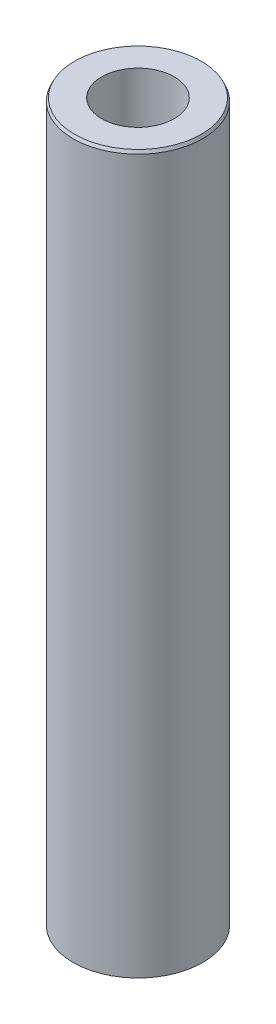
ISO-10303-21;
HEADER;
FILE_DESCRIPTION(('STEP AP214'),'2;1');
FILE_NAME('part.step','',(''),(''),'','','');
FILE_SCHEMA(('AUTOMOTIVE_DESIGN { 1 0 10303 214 1 1 1 1 }'));
ENDSEC;
DATA;
#1=APPLICATION_CONTEXT('core data for automotive mechanical design processes');
#2=APPLICATION_PROTOCOL_DEFINITION('international standard','automotive_design',2000,#1);
#3=PRODUCT_CONTEXT('',#1,'mechanical');
#4=PRODUCT('Part','Part','',(#3));
#5=PRODUCT_RELATED_PRODUCT_CATEGORY('part','',(#4));
#6=PRODUCT_DEFINITION_FORMATION('','',#4);
#7=PRODUCT_DEFINITION_CONTEXT('part definition',#1,'design');
#8=PRODUCT_DEFINITION('design','',#6,#7);
#9=PRODUCT_DEFINITION_SHAPE('','',#8);
#10=(LENGTH_UNIT() NAMED_UNIT(*) SI_UNIT(.MILLI.,.METRE.));
#11=(NAMED_UNIT(*) PLANE_ANGLE_UNIT() SI_UNIT($,.RADIAN.));
#12=(NAMED_UNIT(*) SI_UNIT($,.STERADIAN.) SOLID_ANGLE_UNIT());
#13=UNCERTAINTY_MEASURE_WITH_UNIT(LENGTH_MEASURE(1.E-05),#10,'distance_accuracy_value','');
#14=(GEOMETRIC_REPRESENTATION_CONTEXT(3) GLOBAL_UNCERTAINTY_ASSIGNED_CONTEXT((#13)) GLOBAL_UNIT_ASSIGNED_CONTEXT((#10,
#11,#12)) REPRESENTATION_CONTEXT('',''));
#15=CARTESIAN_POINT('',(0.,0.,0.));
#16=DIRECTION('',(0.,0.,1.));
#17=DIRECTION('',(1.,0.,0.));
#18=AXIS2_PLACEMENT_3D('',#15,#16,#17);
#19=CARTESIAN_POINT('',(0.,415.226512018667,0.));
#20=DIRECTION('',(0.,-1.,0.));
#21=DIRECTION('',(0.,0.,-1.));
#22=AXIS2_PLACEMENT_3D('',#19,#20,#21);
#23=CYLINDRICAL_SURFACE('',#22,37.5);
#24=CARTESIAN_POINT('',(0.,413.442144321352,0.));
#25=DIRECTION('',(0.,1.,0.));
#26=DIRECTION('',(0.,0.,1.));
#27=AXIS2_PLACEMENT_3D('',#24,#25,#26);
#28=CIRCLE('',#27,37.5);
#29=CARTESIAN_POINT('',(0.,413.442144321352,37.5));
#30=VERTEX_POINT('',#29);
#31=EDGE_CURVE('E50',#30,#30,#28,.F.);
#32=ORIENTED_EDGE('',*,*,#31,.T.);
#33=EDGE_LOOP('',(#32));
#34=FACE_BOUND('',#33,.T.);
#35=CARTESIAN_POINT('',(0.,0.858408219421514,0.));
#36=DIRECTION('',(0.,1.,0.));
#37=DIRECTION('',(0.,0.,1.));
#38=AXIS2_PLACEMENT_3D('',#35,#36,#37);
#39=CIRCLE('',#38,37.5);
#40=CARTESIAN_POINT('',(0.,0.858408219421514,37.5));
#41=VERTEX_POINT('',#40);
#42=EDGE_CURVE('E51',#41,#41,#39,.T.);
#43=ORIENTED_EDGE('',*,*,#42,.T.);
#44=EDGE_LOOP('',(#43));
#45=FACE_BOUND('',#44,.T.);
#46=ADVANCED_FACE('F39',(#34,#45),#23,.T.);
#47=CARTESIAN_POINT('',(0.,415.226512018667,0.));
#48=DIRECTION('',(0.,1.,0.));
#49=DIRECTION('',(0.,0.,1.));
#50=AXIS2_PLACEMENT_3D('',#47,#48,#49);
#51=PLANE('',#50);
#52=CARTESIAN_POINT('',(0.,415.226512018667,0.));
#53=DIRECTION('',(0.,1.,0.));
#54=DIRECTION('',(0.,0.,1.));
#55=AXIS2_PLACEMENT_3D('',#52,#53,#54);
#56=CIRCLE('',#55,36.6415917805786);
#57=CARTESIAN_POINT('',(0.,415.226512018667,36.6415917805786));
#58=VERTEX_POINT('',#57);
#59=EDGE_CURVE('E54',#58,#58,#56,.T.);
#60=ORIENTED_EDGE('',*,*,#59,.T.);
#61=EDGE_LOOP('',(#60));
#62=FACE_BOUND('',#61,.T.);
#63=CARTESIAN_POINT('',(0.,415.226512018667,0.));
#64=DIRECTION('',(0.,1.,0.));
#65=DIRECTION('',(0.,0.,1.));
#66=AXIS2_PLACEMENT_3D('',#63,#64,#65);
#67=CIRCLE('',#66,20.9945943141782);
#68=CARTESIAN_POINT('',(0.,415.226512018667,20.9945943141782));
#69=VERTEX_POINT('',#68);
#70=EDGE_CURVE('E58',#69,#69,#67,.T.);
#71=ORIENTED_EDGE('',*,*,#70,.F.);
#72=EDGE_LOOP('',(#71));
#73=FACE_BOUND('',#72,.T.);
#74=ADVANCED_FACE('F69',(#62,#73),#51,.T.);
#75=CARTESIAN_POINT('',(0.,0.,0.));
#76=DIRECTION('',(0.,1.,0.));
#77=DIRECTION('',(0.,0.,1.));
#78=AXIS2_PLACEMENT_3D('',#75,#76,#77);
#79=PLANE('',#78);
#80=CARTESIAN_POINT('',(0.,0.,0.));
#81=DIRECTION('',(0.,1.,0.));
#82=DIRECTION('',(0.,0.,1.));
#83=AXIS2_PLACEMENT_3D('',#80,#81,#82);
#84=CIRCLE('',#83,35.7156323026843);
#85=CARTESIAN_POINT('',(0.,0.,35.7156323026843));
#86=VERTEX_POINT('',#85);
#87=EDGE_CURVE('E10',#86,#86,#84,.F.);
#88=ORIENTED_EDGE('',*,*,#87,.T.);
#89=EDGE_LOOP('',(#88));
#90=FACE_BOUND('',#89,.T.);
#91=CARTESIAN_POINT('',(0.,0.,0.));
#92=DIRECTION('',(0.,1.,0.));
#93=DIRECTION('',(0.,0.,1.));
#94=AXIS2_PLACEMENT_3D('',#91,#92,#93);
#95=CIRCLE('',#94,20.9945943141782);
#96=CARTESIAN_POINT('',(0.,0.,20.9945943141782));
#97=VERTEX_POINT('',#96);
#98=EDGE_CURVE('E63',#97,#97,#95,.T.);
#99=ORIENTED_EDGE('',*,*,#98,.T.);
#100=EDGE_LOOP('',(#99));
#101=FACE_BOUND('',#100,.T.);
#102=ADVANCED_FACE('F75',(#90,#101),#79,.F.);
#103=CARTESIAN_POINT('',(0.,415.226512018667,0.));
#104=DIRECTION('',(0.,-1.,0.));
#105=DIRECTION('',(0.,0.,-1.));
#106=AXIS2_PLACEMENT_3D('',#103,#104,#105);
#107=CYLINDRICAL_SURFACE('',#106,20.9945943141782);
#108=ORIENTED_EDGE('',*,*,#70,.T.);
#109=EDGE_LOOP('',(#108));
#110=FACE_BOUND('',#109,.T.);
#111=ORIENTED_EDGE('',*,*,#98,.F.);
#112=EDGE_LOOP('',(#111));
#113=FACE_BOUND('',#112,.T.);
#114=ADVANCED_FACE('F70',(#110,#113),#107,.F.);
#115=CARTESIAN_POINT('',(0.,415.226512018667,0.));
#116=DIRECTION('',(0.,-1.,0.));
#117=DIRECTION('',(0.,0.,-1.));
#118=AXIS2_PLACEMENT_3D('',#115,#116,#117);
#119=CONICAL_SURFACE('',#118,36.6415917805786,0.448390363545784);
#120=ORIENTED_EDGE('',*,*,#31,.F.);
#121=EDGE_LOOP('',(#120));
#122=FACE_BOUND('',#121,.T.);
#123=ORIENTED_EDGE('',*,*,#59,.F.);
#124=EDGE_LOOP('',(#123));
#125=FACE_BOUND('',#124,.T.);
#126=ADVANCED_FACE('F81',(#122,#125),#119,.T.);
#127=CARTESIAN_POINT('',(0.,0.858408219421514,0.));
#128=DIRECTION('',(0.,1.,0.));
#129=DIRECTION('',(0.,0.,1.));
#130=AXIS2_PLACEMENT_3D('',#127,#128,#129);
#131=CONICAL_SURFACE('',#130,37.5,1.12240596324913);
#132=ORIENTED_EDGE('',*,*,#87,.F.);
#133=EDGE_LOOP('',(#132));
#134=FACE_BOUND('',#133,.T.);
#135=ORIENTED_EDGE('',*,*,#42,.F.);
#136=EDGE_LOOP('',(#135));
#137=FACE_BOUND('',#136,.T.);
#138=ADVANCED_FACE('F45',(#134,#137),#131,.T.);
#139=CLOSED_SHELL('',(#46,#74,#102,#114,#126,#138));
#140=MANIFOLD_SOLID_BREP('B2',#139);
#141=ADVANCED_BREP_SHAPE_REPRESENTATION('',(#18,#140),#14);
#142=SHAPE_DEFINITION_REPRESENTATION(#9,#141);
ENDSEC;
END-ISO-10303-21;
